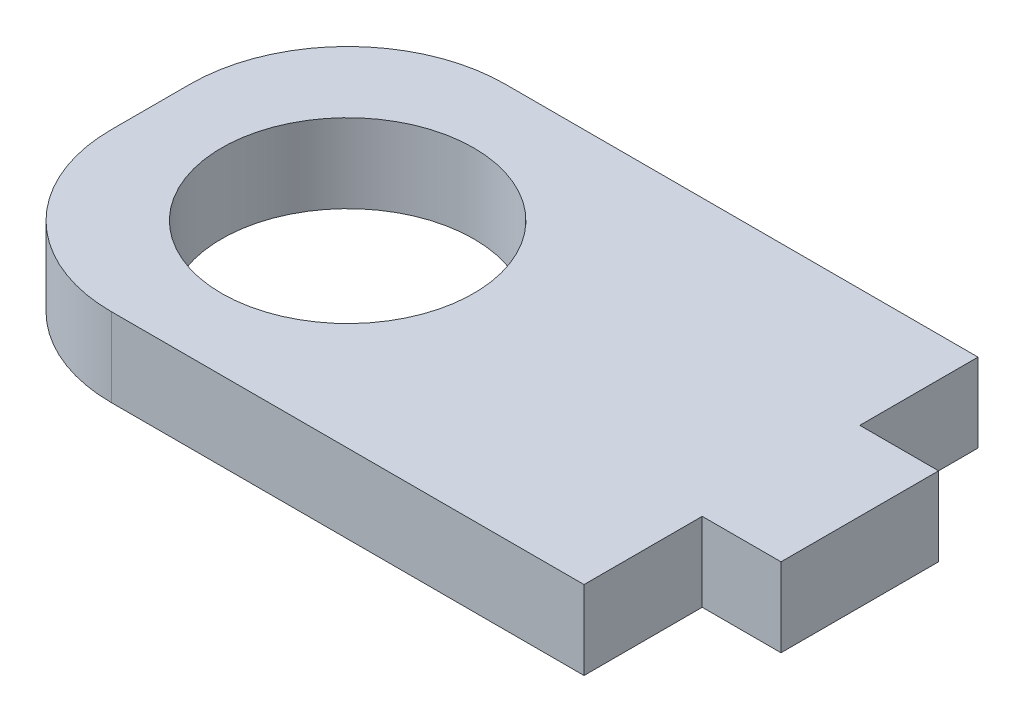
ISO-10303-21;
HEADER;
FILE_DESCRIPTION(('STEP AP214'),'2;1');
FILE_NAME('part.step','',(''),(''),'','','');
FILE_SCHEMA(('AUTOMOTIVE_DESIGN { 1 0 10303 214 1 1 1 1 }'));
ENDSEC;
DATA;
#1=APPLICATION_CONTEXT('core data for automotive mechanical design processes');
#2=APPLICATION_PROTOCOL_DEFINITION('international standard','automotive_design',2000,#1);
#3=PRODUCT_CONTEXT('',#1,'mechanical');
#4=PRODUCT('Part','Part','',(#3));
#5=PRODUCT_RELATED_PRODUCT_CATEGORY('part','',(#4));
#6=PRODUCT_DEFINITION_FORMATION('','',#4);
#7=PRODUCT_DEFINITION_CONTEXT('part definition',#1,'design');
#8=PRODUCT_DEFINITION('design','',#6,#7);
#9=PRODUCT_DEFINITION_SHAPE('','',#8);
#10=(LENGTH_UNIT() NAMED_UNIT(*) SI_UNIT(.MILLI.,.METRE.));
#11=(NAMED_UNIT(*) PLANE_ANGLE_UNIT() SI_UNIT($,.RADIAN.));
#12=(NAMED_UNIT(*) SI_UNIT($,.STERADIAN.) SOLID_ANGLE_UNIT());
#13=UNCERTAINTY_MEASURE_WITH_UNIT(LENGTH_MEASURE(1.E-05),#10,'distance_accuracy_value','');
#14=(GEOMETRIC_REPRESENTATION_CONTEXT(3) GLOBAL_UNCERTAINTY_ASSIGNED_CONTEXT((#13)) GLOBAL_UNIT_ASSIGNED_CONTEXT((#10,
#11,#12)) REPRESENTATION_CONTEXT('',''));
#15=CARTESIAN_POINT('',(0.,0.,0.));
#16=DIRECTION('',(0.,0.,1.));
#17=DIRECTION('',(1.,0.,0.));
#18=AXIS2_PLACEMENT_3D('',#15,#16,#17);
#19=CARTESIAN_POINT('',(0.,5.,0.));
#20=DIRECTION('',(0.,1.,0.));
#21=DIRECTION('',(0.,0.,1.));
#22=AXIS2_PLACEMENT_3D('',#19,#20,#21);
#23=PLANE('',#22);
#24=DIRECTION('',(-1.,0.,0.));
#25=VECTOR('',#24,1.);
#26=CARTESIAN_POINT('',(0.,5.,0.));
#27=LINE('',#26,#25);
#28=CARTESIAN_POINT('',(40.,5.,0.));
#29=VERTEX_POINT('',#28);
#30=CARTESIAN_POINT('',(10.,5.,0.));
#31=VERTEX_POINT('',#30);
#32=EDGE_CURVE('E161',#29,#31,#27,.T.);
#33=ORIENTED_EDGE('',*,*,#32,.T.);
#34=CARTESIAN_POINT('',(10.,5.,10.));
#35=DIRECTION('',(0.,1.,0.));
#36=DIRECTION('',(0.,0.,1.));
#37=AXIS2_PLACEMENT_3D('',#34,#35,#36);
#38=CIRCLE('',#37,10.);
#39=CARTESIAN_POINT('',(0.,5.,10.));
#40=VERTEX_POINT('',#39);
#41=EDGE_CURVE('E48',#31,#40,#38,.T.);
#42=ORIENTED_EDGE('',*,*,#41,.T.);
#43=DIRECTION('',(0.,0.,1.));
#44=VECTOR('',#43,1.);
#45=CARTESIAN_POINT('',(0.,5.,0.));
#46=LINE('',#45,#44);
#47=CARTESIAN_POINT('',(0.,5.,15.));
#48=VERTEX_POINT('',#47);
#49=EDGE_CURVE('E132',#40,#48,#46,.T.);
#50=ORIENTED_EDGE('',*,*,#49,.T.);
#51=CARTESIAN_POINT('',(10.,5.,15.));
#52=DIRECTION('',(0.,1.,0.));
#53=DIRECTION('',(0.,0.,1.));
#54=AXIS2_PLACEMENT_3D('',#51,#52,#53);
#55=CIRCLE('',#54,10.);
#56=CARTESIAN_POINT('',(10.,5.,25.));
#57=VERTEX_POINT('',#56);
#58=EDGE_CURVE('E57',#48,#57,#55,.T.);
#59=ORIENTED_EDGE('',*,*,#58,.T.);
#60=DIRECTION('',(1.,0.,0.));
#61=VECTOR('',#60,1.);
#62=CARTESIAN_POINT('',(0.,5.,25.));
#63=LINE('',#62,#61);
#64=CARTESIAN_POINT('',(40.,5.,25.));
#65=VERTEX_POINT('',#64);
#66=EDGE_CURVE('E123',#57,#65,#63,.T.);
#67=ORIENTED_EDGE('',*,*,#66,.T.);
#68=DIRECTION('',(0.,0.,-1.));
#69=VECTOR('',#68,1.);
#70=CARTESIAN_POINT('',(40.,5.,17.5));
#71=LINE('',#70,#69);
#72=CARTESIAN_POINT('',(40.,5.,17.5));
#73=VERTEX_POINT('',#72);
#74=EDGE_CURVE('E127',#65,#73,#71,.T.);
#75=ORIENTED_EDGE('',*,*,#74,.T.);
#76=DIRECTION('',(1.,0.,0.));
#77=VECTOR('',#76,1.);
#78=CARTESIAN_POINT('',(45.,5.,17.5));
#79=LINE('',#78,#77);
#80=CARTESIAN_POINT('',(45.,5.,17.5));
#81=VERTEX_POINT('',#80);
#82=EDGE_CURVE('E147',#73,#81,#79,.T.);
#83=ORIENTED_EDGE('',*,*,#82,.T.);
#84=DIRECTION('',(0.,0.,-1.));
#85=VECTOR('',#84,1.);
#86=CARTESIAN_POINT('',(45.,5.,7.5));
#87=LINE('',#86,#85);
#88=CARTESIAN_POINT('',(45.,5.,7.5));
#89=VERTEX_POINT('',#88);
#90=EDGE_CURVE('E149',#81,#89,#87,.T.);
#91=ORIENTED_EDGE('',*,*,#90,.T.);
#92=DIRECTION('',(-1.,0.,0.));
#93=VECTOR('',#92,1.);
#94=CARTESIAN_POINT('',(40.,5.,7.5));
#95=LINE('',#94,#93);
#96=CARTESIAN_POINT('',(40.,5.,7.5));
#97=VERTEX_POINT('',#96);
#98=EDGE_CURVE('E155',#89,#97,#95,.T.);
#99=ORIENTED_EDGE('',*,*,#98,.T.);
#100=DIRECTION('',(0.,0.,-1.));
#101=VECTOR('',#100,1.);
#102=CARTESIAN_POINT('',(40.,5.,0.));
#103=LINE('',#102,#101);
#104=EDGE_CURVE('E158',#97,#29,#103,.T.);
#105=ORIENTED_EDGE('',*,*,#104,.T.);
#106=EDGE_LOOP('',(#33,#42,#50,#59,#67,#75,#83,#91,#99,#105));
#107=FACE_BOUND('',#106,.T.);
#108=CARTESIAN_POINT('',(12.5,5.,12.5));
#109=DIRECTION('',(0.,1.,0.));
#110=DIRECTION('',(0.,0.,1.));
#111=AXIS2_PLACEMENT_3D('',#108,#109,#110);
#112=CIRCLE('',#111,8.);
#113=CARTESIAN_POINT('',(12.5,5.,20.5));
#114=VERTEX_POINT('',#113);
#115=EDGE_CURVE('E168',#114,#114,#112,.T.);
#116=ORIENTED_EDGE('',*,*,#115,.F.);
#117=EDGE_LOOP('',(#116));
#118=FACE_BOUND('',#117,.T.);
#119=ADVANCED_FACE('F39',(#107,#118),#23,.T.);
#120=CARTESIAN_POINT('',(0.,0.,0.));
#121=DIRECTION('',(0.,1.,0.));
#122=DIRECTION('',(0.,0.,1.));
#123=AXIS2_PLACEMENT_3D('',#120,#121,#122);
#124=PLANE('',#123);
#125=DIRECTION('',(0.,0.,1.));
#126=VECTOR('',#125,1.);
#127=CARTESIAN_POINT('',(0.,0.,0.));
#128=LINE('',#127,#126);
#129=CARTESIAN_POINT('',(0.,0.,10.));
#130=VERTEX_POINT('',#129);
#131=CARTESIAN_POINT('',(0.,0.,15.));
#132=VERTEX_POINT('',#131);
#133=EDGE_CURVE('E165',#130,#132,#128,.T.);
#134=ORIENTED_EDGE('',*,*,#133,.F.);
#135=CARTESIAN_POINT('',(10.,0.,10.));
#136=DIRECTION('',(0.,1.,0.));
#137=DIRECTION('',(0.,0.,1.));
#138=AXIS2_PLACEMENT_3D('',#135,#136,#137);
#139=CIRCLE('',#138,10.);
#140=CARTESIAN_POINT('',(10.,0.,0.));
#141=VERTEX_POINT('',#140);
#142=EDGE_CURVE('E204',#130,#141,#139,.F.);
#143=ORIENTED_EDGE('',*,*,#142,.T.);
#144=DIRECTION('',(-1.,0.,0.));
#145=VECTOR('',#144,1.);
#146=CARTESIAN_POINT('',(0.,0.,0.));
#147=LINE('',#146,#145);
#148=CARTESIAN_POINT('',(40.,0.,0.));
#149=VERTEX_POINT('',#148);
#150=EDGE_CURVE('E180',#149,#141,#147,.T.);
#151=ORIENTED_EDGE('',*,*,#150,.F.);
#152=DIRECTION('',(0.,0.,-1.));
#153=VECTOR('',#152,1.);
#154=CARTESIAN_POINT('',(40.,0.,0.));
#155=LINE('',#154,#153);
#156=CARTESIAN_POINT('',(40.,0.,7.5));
#157=VERTEX_POINT('',#156);
#158=EDGE_CURVE('E178',#157,#149,#155,.T.);
#159=ORIENTED_EDGE('',*,*,#158,.F.);
#160=DIRECTION('',(-1.,0.,0.));
#161=VECTOR('',#160,1.);
#162=CARTESIAN_POINT('',(40.,0.,7.5));
#163=LINE('',#162,#161);
#164=CARTESIAN_POINT('',(45.,0.,7.5));
#165=VERTEX_POINT('',#164);
#166=EDGE_CURVE('E176',#165,#157,#163,.T.);
#167=ORIENTED_EDGE('',*,*,#166,.F.);
#168=DIRECTION('',(0.,0.,-1.));
#169=VECTOR('',#168,1.);
#170=CARTESIAN_POINT('',(45.,0.,7.5));
#171=LINE('',#170,#169);
#172=CARTESIAN_POINT('',(45.,0.,17.5));
#173=VERTEX_POINT('',#172);
#174=EDGE_CURVE('E174',#173,#165,#171,.T.);
#175=ORIENTED_EDGE('',*,*,#174,.F.);
#176=DIRECTION('',(1.,0.,0.));
#177=VECTOR('',#176,1.);
#178=CARTESIAN_POINT('',(45.,0.,17.5));
#179=LINE('',#178,#177);
#180=CARTESIAN_POINT('',(40.,0.,17.5));
#181=VERTEX_POINT('',#180);
#182=EDGE_CURVE('E172',#181,#173,#179,.T.);
#183=ORIENTED_EDGE('',*,*,#182,.F.);
#184=DIRECTION('',(0.,0.,-1.));
#185=VECTOR('',#184,1.);
#186=CARTESIAN_POINT('',(40.,0.,17.5));
#187=LINE('',#186,#185);
#188=CARTESIAN_POINT('',(40.,0.,25.));
#189=VERTEX_POINT('',#188);
#190=EDGE_CURVE('E170',#189,#181,#187,.T.);
#191=ORIENTED_EDGE('',*,*,#190,.F.);
#192=DIRECTION('',(1.,0.,0.));
#193=VECTOR('',#192,1.);
#194=CARTESIAN_POINT('',(0.,0.,25.));
#195=LINE('',#194,#193);
#196=CARTESIAN_POINT('',(10.,0.,25.));
#197=VERTEX_POINT('',#196);
#198=EDGE_CURVE('E138',#197,#189,#195,.T.);
#199=ORIENTED_EDGE('',*,*,#198,.F.);
#200=CARTESIAN_POINT('',(10.,0.,15.));
#201=DIRECTION('',(0.,1.,0.));
#202=DIRECTION('',(0.,0.,1.));
#203=AXIS2_PLACEMENT_3D('',#200,#201,#202);
#204=CIRCLE('',#203,10.);
#205=EDGE_CURVE('E202',#197,#132,#204,.F.);
#206=ORIENTED_EDGE('',*,*,#205,.T.);
#207=EDGE_LOOP('',(#134,#143,#151,#159,#167,#175,#183,#191,#199,#206));
#208=FACE_BOUND('',#207,.T.);
#209=CARTESIAN_POINT('',(12.5,0.,12.5));
#210=DIRECTION('',(0.,1.,0.));
#211=DIRECTION('',(0.,0.,1.));
#212=AXIS2_PLACEMENT_3D('',#209,#210,#211);
#213=CIRCLE('',#212,8.);
#214=CARTESIAN_POINT('',(12.5,0.,20.5));
#215=VERTEX_POINT('',#214);
#216=EDGE_CURVE('E354',#215,#215,#213,.T.);
#217=ORIENTED_EDGE('',*,*,#216,.T.);
#218=EDGE_LOOP('',(#217));
#219=FACE_BOUND('',#218,.T.);
#220=ADVANCED_FACE('F222',(#208,#219),#124,.F.);
#221=CARTESIAN_POINT('',(0.,5.,0.));
#222=DIRECTION('',(1.,0.,0.));
#223=DIRECTION('',(0.,0.,-1.));
#224=AXIS2_PLACEMENT_3D('',#221,#222,#223);
#225=PLANE('',#224);
#226=ORIENTED_EDGE('',*,*,#49,.F.);
#227=DIRECTION('',(0.,-1.,0.));
#228=VECTOR('',#227,1.);
#229=CARTESIAN_POINT('',(0.,5.,10.));
#230=LINE('',#229,#228);
#231=EDGE_CURVE('E199',#40,#130,#230,.T.);
#232=ORIENTED_EDGE('',*,*,#231,.T.);
#233=ORIENTED_EDGE('',*,*,#133,.T.);
#234=DIRECTION('',(0.,-1.,0.));
#235=VECTOR('',#234,1.);
#236=CARTESIAN_POINT('',(0.,5.,15.));
#237=LINE('',#236,#235);
#238=EDGE_CURVE('E141',#132,#48,#237,.F.);
#239=ORIENTED_EDGE('',*,*,#238,.T.);
#240=EDGE_LOOP('',(#226,#232,#233,#239));
#241=FACE_BOUND('',#240,.T.);
#242=ADVANCED_FACE('F216',(#241),#225,.F.);
#243=CARTESIAN_POINT('',(0.,5.,25.));
#244=DIRECTION('',(0.,0.,-1.));
#245=DIRECTION('',(-1.,0.,0.));
#246=AXIS2_PLACEMENT_3D('',#243,#244,#245);
#247=PLANE('',#246);
#248=ORIENTED_EDGE('',*,*,#66,.F.);
#249=DIRECTION('',(0.,-1.,0.));
#250=VECTOR('',#249,1.);
#251=CARTESIAN_POINT('',(10.,5.,25.));
#252=LINE('',#251,#250);
#253=EDGE_CURVE('E11',#57,#197,#252,.T.);
#254=ORIENTED_EDGE('',*,*,#253,.T.);
#255=ORIENTED_EDGE('',*,*,#198,.T.);
#256=DIRECTION('',(0.,-1.,0.));
#257=VECTOR('',#256,1.);
#258=CARTESIAN_POINT('',(40.,5.,25.));
#259=LINE('',#258,#257);
#260=EDGE_CURVE('E135',#65,#189,#259,.T.);
#261=ORIENTED_EDGE('',*,*,#260,.F.);
#262=EDGE_LOOP('',(#248,#254,#255,#261));
#263=FACE_BOUND('',#262,.T.);
#264=ADVANCED_FACE('F136',(#263),#247,.F.);
#265=CARTESIAN_POINT('',(40.,5.,17.5));
#266=DIRECTION('',(-1.,0.,0.));
#267=DIRECTION('',(0.,0.,1.));
#268=AXIS2_PLACEMENT_3D('',#265,#266,#267);
#269=PLANE('',#268);
#270=ORIENTED_EDGE('',*,*,#190,.T.);
#271=DIRECTION('',(0.,-1.,0.));
#272=VECTOR('',#271,1.);
#273=CARTESIAN_POINT('',(40.,5.,17.5));
#274=LINE('',#273,#272);
#275=EDGE_CURVE('E142',#73,#181,#274,.T.);
#276=ORIENTED_EDGE('',*,*,#275,.F.);
#277=ORIENTED_EDGE('',*,*,#74,.F.);
#278=ORIENTED_EDGE('',*,*,#260,.T.);
#279=EDGE_LOOP('',(#270,#276,#277,#278));
#280=FACE_BOUND('',#279,.T.);
#281=ADVANCED_FACE('F144',(#280),#269,.F.);
#282=CARTESIAN_POINT('',(45.,5.,17.5));
#283=DIRECTION('',(0.,0.,-1.));
#284=DIRECTION('',(-1.,0.,0.));
#285=AXIS2_PLACEMENT_3D('',#282,#283,#284);
#286=PLANE('',#285);
#287=ORIENTED_EDGE('',*,*,#182,.T.);
#288=DIRECTION('',(0.,-1.,0.));
#289=VECTOR('',#288,1.);
#290=CARTESIAN_POINT('',(45.,5.,17.5));
#291=LINE('',#290,#289);
#292=EDGE_CURVE('E194',#81,#173,#291,.T.);
#293=ORIENTED_EDGE('',*,*,#292,.F.);
#294=ORIENTED_EDGE('',*,*,#82,.F.);
#295=ORIENTED_EDGE('',*,*,#275,.T.);
#296=EDGE_LOOP('',(#287,#293,#294,#295));
#297=FACE_BOUND('',#296,.T.);
#298=ADVANCED_FACE('F243',(#297),#286,.F.);
#299=CARTESIAN_POINT('',(45.,5.,7.5));
#300=DIRECTION('',(-1.,0.,0.));
#301=DIRECTION('',(0.,0.,1.));
#302=AXIS2_PLACEMENT_3D('',#299,#300,#301);
#303=PLANE('',#302);
#304=ORIENTED_EDGE('',*,*,#174,.T.);
#305=DIRECTION('',(0.,-1.,0.));
#306=VECTOR('',#305,1.);
#307=CARTESIAN_POINT('',(45.,5.,7.5));
#308=LINE('',#307,#306);
#309=EDGE_CURVE('E190',#89,#165,#308,.T.);
#310=ORIENTED_EDGE('',*,*,#309,.F.);
#311=ORIENTED_EDGE('',*,*,#90,.F.);
#312=ORIENTED_EDGE('',*,*,#292,.T.);
#313=EDGE_LOOP('',(#304,#310,#311,#312));
#314=FACE_BOUND('',#313,.T.);
#315=ADVANCED_FACE('F240',(#314),#303,.F.);
#316=CARTESIAN_POINT('',(40.,5.,7.5));
#317=DIRECTION('',(0.,0.,1.));
#318=DIRECTION('',(1.,0.,0.));
#319=AXIS2_PLACEMENT_3D('',#316,#317,#318);
#320=PLANE('',#319);
#321=ORIENTED_EDGE('',*,*,#166,.T.);
#322=DIRECTION('',(0.,-1.,0.));
#323=VECTOR('',#322,1.);
#324=CARTESIAN_POINT('',(40.,5.,7.5));
#325=LINE('',#324,#323);
#326=EDGE_CURVE('E186',#97,#157,#325,.T.);
#327=ORIENTED_EDGE('',*,*,#326,.F.);
#328=ORIENTED_EDGE('',*,*,#98,.F.);
#329=ORIENTED_EDGE('',*,*,#309,.T.);
#330=EDGE_LOOP('',(#321,#327,#328,#329));
#331=FACE_BOUND('',#330,.T.);
#332=ADVANCED_FACE('F235',(#331),#320,.F.);
#333=CARTESIAN_POINT('',(40.,5.,0.));
#334=DIRECTION('',(-1.,0.,0.));
#335=DIRECTION('',(0.,0.,1.));
#336=AXIS2_PLACEMENT_3D('',#333,#334,#335);
#337=PLANE('',#336);
#338=ORIENTED_EDGE('',*,*,#158,.T.);
#339=DIRECTION('',(0.,-1.,0.));
#340=VECTOR('',#339,1.);
#341=CARTESIAN_POINT('',(40.,5.,0.));
#342=LINE('',#341,#340);
#343=EDGE_CURVE('E164',#29,#149,#342,.T.);
#344=ORIENTED_EDGE('',*,*,#343,.F.);
#345=ORIENTED_EDGE('',*,*,#104,.F.);
#346=ORIENTED_EDGE('',*,*,#326,.T.);
#347=EDGE_LOOP('',(#338,#344,#345,#346));
#348=FACE_BOUND('',#347,.T.);
#349=ADVANCED_FACE('F229',(#348),#337,.F.);
#350=CARTESIAN_POINT('',(0.,5.,0.));
#351=DIRECTION('',(0.,0.,1.));
#352=DIRECTION('',(1.,0.,0.));
#353=AXIS2_PLACEMENT_3D('',#350,#351,#352);
#354=PLANE('',#353);
#355=ORIENTED_EDGE('',*,*,#150,.T.);
#356=DIRECTION('',(0.,-1.,0.));
#357=VECTOR('',#356,1.);
#358=CARTESIAN_POINT('',(10.,5.,0.));
#359=LINE('',#358,#357);
#360=EDGE_CURVE('E68',#141,#31,#359,.F.);
#361=ORIENTED_EDGE('',*,*,#360,.T.);
#362=ORIENTED_EDGE('',*,*,#32,.F.);
#363=ORIENTED_EDGE('',*,*,#343,.T.);
#364=EDGE_LOOP('',(#355,#361,#362,#363));
#365=FACE_BOUND('',#364,.T.);
#366=ADVANCED_FACE('F225',(#365),#354,.F.);
#367=CARTESIAN_POINT('',(12.5,5.,12.5));
#368=DIRECTION('',(0.,-1.,0.));
#369=DIRECTION('',(0.,0.,-1.));
#370=AXIS2_PLACEMENT_3D('',#367,#368,#369);
#371=CYLINDRICAL_SURFACE('',#370,8.);
#372=ORIENTED_EDGE('',*,*,#115,.T.);
#373=EDGE_LOOP('',(#372));
#374=FACE_BOUND('',#373,.T.);
#375=ORIENTED_EDGE('',*,*,#216,.F.);
#376=EDGE_LOOP('',(#375));
#377=FACE_BOUND('',#376,.T.);
#378=ADVANCED_FACE('F249',(#374,#377),#371,.F.);
#379=CARTESIAN_POINT('',(10.,5.,10.));
#380=DIRECTION('',(0.,-1.,0.));
#381=DIRECTION('',(0.,0.,-1.));
#382=AXIS2_PLACEMENT_3D('',#379,#380,#381);
#383=CYLINDRICAL_SURFACE('',#382,10.);
#384=ORIENTED_EDGE('',*,*,#41,.F.);
#385=ORIENTED_EDGE('',*,*,#360,.F.);
#386=ORIENTED_EDGE('',*,*,#142,.F.);
#387=ORIENTED_EDGE('',*,*,#231,.F.);
#388=EDGE_LOOP('',(#384,#385,#386,#387));
#389=FACE_BOUND('',#388,.T.);
#390=ADVANCED_FACE('F219',(#389),#383,.T.);
#391=CARTESIAN_POINT('',(10.,5.,15.));
#392=DIRECTION('',(0.,-1.,0.));
#393=DIRECTION('',(0.,0.,-1.));
#394=AXIS2_PLACEMENT_3D('',#391,#392,#393);
#395=CYLINDRICAL_SURFACE('',#394,10.);
#396=ORIENTED_EDGE('',*,*,#58,.F.);
#397=ORIENTED_EDGE('',*,*,#238,.F.);
#398=ORIENTED_EDGE('',*,*,#205,.F.);
#399=ORIENTED_EDGE('',*,*,#253,.F.);
#400=EDGE_LOOP('',(#396,#397,#398,#399));
#401=FACE_BOUND('',#400,.T.);
#402=ADVANCED_FACE('F41',(#401),#395,.T.);
#403=CLOSED_SHELL('',(#119,#220,#242,#264,#281,#298,#315,#332,#349,#366,#378,#390,#402));
#404=MANIFOLD_SOLID_BREP('B2',#403);
#405=ADVANCED_BREP_SHAPE_REPRESENTATION('',(#18,#404),#14);
#406=SHAPE_DEFINITION_REPRESENTATION(#9,#405);
ENDSEC;
END-ISO-10303-21;
